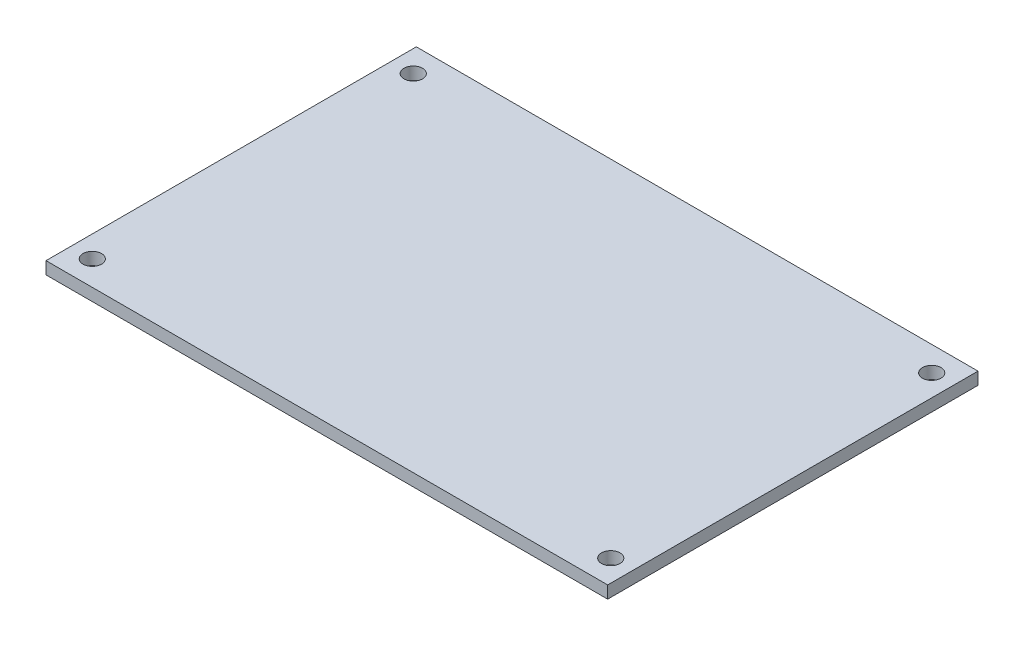
ISO-10303-21;
HEADER;
FILE_DESCRIPTION(('STEP AP214'),'2;1');
FILE_NAME('part.step','',(''),(''),'','','');
FILE_SCHEMA(('AUTOMOTIVE_DESIGN { 1 0 10303 214 1 1 1 1 }'));
ENDSEC;
DATA;
#1=APPLICATION_CONTEXT('core data for automotive mechanical design processes');
#2=APPLICATION_PROTOCOL_DEFINITION('international standard','automotive_design',2000,#1);
#3=PRODUCT_CONTEXT('',#1,'mechanical');
#4=PRODUCT('Part','Part','',(#3));
#5=PRODUCT_RELATED_PRODUCT_CATEGORY('part','',(#4));
#6=PRODUCT_DEFINITION_FORMATION('','',#4);
#7=PRODUCT_DEFINITION_CONTEXT('part definition',#1,'design');
#8=PRODUCT_DEFINITION('design','',#6,#7);
#9=PRODUCT_DEFINITION_SHAPE('','',#8);
#10=(LENGTH_UNIT() NAMED_UNIT(*) SI_UNIT(.MILLI.,.METRE.));
#11=(NAMED_UNIT(*) PLANE_ANGLE_UNIT() SI_UNIT($,.RADIAN.));
#12=(NAMED_UNIT(*) SI_UNIT($,.STERADIAN.) SOLID_ANGLE_UNIT());
#13=UNCERTAINTY_MEASURE_WITH_UNIT(LENGTH_MEASURE(1.E-05),#10,'distance_accuracy_value','');
#14=(GEOMETRIC_REPRESENTATION_CONTEXT(3) GLOBAL_UNCERTAINTY_ASSIGNED_CONTEXT((#13)) GLOBAL_UNIT_ASSIGNED_CONTEXT((#10,
#11,#12)) REPRESENTATION_CONTEXT('',''));
#15=CARTESIAN_POINT('',(0.,0.,0.));
#16=DIRECTION('',(0.,0.,1.));
#17=DIRECTION('',(1.,0.,0.));
#18=AXIS2_PLACEMENT_3D('',#15,#16,#17);
#19=CARTESIAN_POINT('',(45.5,2.,-30.));
#20=DIRECTION('',(-1.,0.,0.));
#21=DIRECTION('',(0.,0.,1.));
#22=AXIS2_PLACEMENT_3D('',#19,#20,#21);
#23=PLANE('',#22);
#24=DIRECTION('',(0.,0.,-1.));
#25=VECTOR('',#24,1.);
#26=CARTESIAN_POINT('',(45.5,0.,-30.));
#27=LINE('',#26,#25);
#28=CARTESIAN_POINT('',(45.5,0.,30.));
#29=VERTEX_POINT('',#28);
#30=CARTESIAN_POINT('',(45.5,0.,-30.));
#31=VERTEX_POINT('',#30);
#32=EDGE_CURVE('E97',#29,#31,#27,.T.);
#33=ORIENTED_EDGE('',*,*,#32,.T.);
#34=DIRECTION('',(0.,-1.,0.));
#35=VECTOR('',#34,1.);
#36=CARTESIAN_POINT('',(45.5,2.,-30.));
#37=LINE('',#36,#35);
#38=CARTESIAN_POINT('',(45.5,2.,-30.));
#39=VERTEX_POINT('',#38);
#40=EDGE_CURVE('E11',#39,#31,#37,.T.);
#41=ORIENTED_EDGE('',*,*,#40,.F.);
#42=DIRECTION('',(0.,0.,-1.));
#43=VECTOR('',#42,1.);
#44=CARTESIAN_POINT('',(45.5,2.,-30.));
#45=LINE('',#44,#43);
#46=CARTESIAN_POINT('',(45.5,2.,30.));
#47=VERTEX_POINT('',#46);
#48=EDGE_CURVE('E85',#47,#39,#45,.T.);
#49=ORIENTED_EDGE('',*,*,#48,.F.);
#50=DIRECTION('',(0.,-1.,0.));
#51=VECTOR('',#50,1.);
#52=CARTESIAN_POINT('',(45.5,2.,30.));
#53=LINE('',#52,#51);
#54=EDGE_CURVE('E93',#47,#29,#53,.T.);
#55=ORIENTED_EDGE('',*,*,#54,.T.);
#56=EDGE_LOOP('',(#33,#41,#49,#55));
#57=FACE_BOUND('',#56,.T.);
#58=ADVANCED_FACE('F34',(#57),#23,.F.);
#59=CARTESIAN_POINT('',(-45.5,2.,-30.));
#60=DIRECTION('',(0.,0.,1.));
#61=DIRECTION('',(1.,0.,0.));
#62=AXIS2_PLACEMENT_3D('',#59,#60,#61);
#63=PLANE('',#62);
#64=DIRECTION('',(-1.,0.,0.));
#65=VECTOR('',#64,1.);
#66=CARTESIAN_POINT('',(-45.5,0.,-30.));
#67=LINE('',#66,#65);
#68=CARTESIAN_POINT('',(-45.5,0.,-30.));
#69=VERTEX_POINT('',#68);
#70=EDGE_CURVE('E89',#31,#69,#67,.T.);
#71=ORIENTED_EDGE('',*,*,#70,.T.);
#72=DIRECTION('',(0.,-1.,0.));
#73=VECTOR('',#72,1.);
#74=CARTESIAN_POINT('',(-45.5,2.,-30.));
#75=LINE('',#74,#73);
#76=CARTESIAN_POINT('',(-45.5,2.,-30.));
#77=VERTEX_POINT('',#76);
#78=EDGE_CURVE('E42',#77,#69,#75,.T.);
#79=ORIENTED_EDGE('',*,*,#78,.F.);
#80=DIRECTION('',(-1.,0.,0.));
#81=VECTOR('',#80,1.);
#82=CARTESIAN_POINT('',(-45.5,2.,-30.));
#83=LINE('',#82,#81);
#84=EDGE_CURVE('E80',#39,#77,#83,.T.);
#85=ORIENTED_EDGE('',*,*,#84,.F.);
#86=ORIENTED_EDGE('',*,*,#40,.T.);
#87=EDGE_LOOP('',(#71,#79,#85,#86));
#88=FACE_BOUND('',#87,.T.);
#89=ADVANCED_FACE('F88',(#88),#63,.F.);
#90=CARTESIAN_POINT('',(-45.5,2.,-30.));
#91=DIRECTION('',(1.,0.,0.));
#92=DIRECTION('',(0.,0.,-1.));
#93=AXIS2_PLACEMENT_3D('',#90,#91,#92);
#94=PLANE('',#93);
#95=DIRECTION('',(0.,0.,1.));
#96=VECTOR('',#95,1.);
#97=CARTESIAN_POINT('',(-45.5,0.,-30.));
#98=LINE('',#97,#96);
#99=CARTESIAN_POINT('',(-45.5,0.,30.));
#100=VERTEX_POINT('',#99);
#101=EDGE_CURVE('E67',#69,#100,#98,.T.);
#102=ORIENTED_EDGE('',*,*,#101,.T.);
#103=DIRECTION('',(0.,-1.,0.));
#104=VECTOR('',#103,1.);
#105=CARTESIAN_POINT('',(-45.5,2.,30.));
#106=LINE('',#105,#104);
#107=CARTESIAN_POINT('',(-45.5,2.,30.));
#108=VERTEX_POINT('',#107);
#109=EDGE_CURVE('E90',#108,#100,#106,.T.);
#110=ORIENTED_EDGE('',*,*,#109,.F.);
#111=DIRECTION('',(0.,0.,1.));
#112=VECTOR('',#111,1.);
#113=CARTESIAN_POINT('',(-45.5,2.,-30.));
#114=LINE('',#113,#112);
#115=EDGE_CURVE('E83',#77,#108,#114,.T.);
#116=ORIENTED_EDGE('',*,*,#115,.F.);
#117=ORIENTED_EDGE('',*,*,#78,.T.);
#118=EDGE_LOOP('',(#102,#110,#116,#117));
#119=FACE_BOUND('',#118,.T.);
#120=ADVANCED_FACE('F91',(#119),#94,.F.);
#121=CARTESIAN_POINT('',(-45.5,2.,30.));
#122=DIRECTION('',(0.,0.,-1.));
#123=DIRECTION('',(-1.,0.,0.));
#124=AXIS2_PLACEMENT_3D('',#121,#122,#123);
#125=PLANE('',#124);
#126=DIRECTION('',(1.,0.,0.));
#127=VECTOR('',#126,1.);
#128=CARTESIAN_POINT('',(-45.5,0.,30.));
#129=LINE('',#128,#127);
#130=EDGE_CURVE('E73',#100,#29,#129,.T.);
#131=ORIENTED_EDGE('',*,*,#130,.T.);
#132=ORIENTED_EDGE('',*,*,#54,.F.);
#133=DIRECTION('',(1.,0.,0.));
#134=VECTOR('',#133,1.);
#135=CARTESIAN_POINT('',(-45.5,2.,30.));
#136=LINE('',#135,#134);
#137=EDGE_CURVE('E50',#108,#47,#136,.T.);
#138=ORIENTED_EDGE('',*,*,#137,.F.);
#139=ORIENTED_EDGE('',*,*,#109,.T.);
#140=EDGE_LOOP('',(#131,#132,#138,#139));
#141=FACE_BOUND('',#140,.T.);
#142=ADVANCED_FACE('F105',(#141),#125,.F.);
#143=CARTESIAN_POINT('',(0.,2.,0.));
#144=DIRECTION('',(0.,1.,0.));
#145=DIRECTION('',(0.,0.,1.));
#146=AXIS2_PLACEMENT_3D('',#143,#144,#145);
#147=PLANE('',#146);
#148=CARTESIAN_POINT('',(42.,2.,-26.));
#149=DIRECTION('',(0.,1.,0.));
#150=DIRECTION('',(0.,0.,-1.));
#151=AXIS2_PLACEMENT_3D('',#148,#149,#150);
#152=CIRCLE('',#151,1.5);
#153=CARTESIAN_POINT('',(42.,2.,-27.5));
#154=VERTEX_POINT('',#153);
#155=EDGE_CURVE('E124',#154,#154,#152,.T.);
#156=ORIENTED_EDGE('',*,*,#155,.F.);
#157=EDGE_LOOP('',(#156));
#158=FACE_BOUND('',#157,.T.);
#159=CARTESIAN_POINT('',(-42.,2.,26.));
#160=DIRECTION('',(0.,1.,0.));
#161=DIRECTION('',(0.,0.,-1.));
#162=AXIS2_PLACEMENT_3D('',#159,#160,#161);
#163=CIRCLE('',#162,1.5);
#164=CARTESIAN_POINT('',(-42.,2.,24.5));
#165=VERTEX_POINT('',#164);
#166=EDGE_CURVE('E117',#165,#165,#163,.T.);
#167=ORIENTED_EDGE('',*,*,#166,.F.);
#168=EDGE_LOOP('',(#167));
#169=FACE_BOUND('',#168,.T.);
#170=CARTESIAN_POINT('',(42.,2.,26.));
#171=DIRECTION('',(0.,1.,0.));
#172=DIRECTION('',(0.,0.,1.));
#173=AXIS2_PLACEMENT_3D('',#170,#171,#172);
#174=CIRCLE('',#173,1.5);
#175=CARTESIAN_POINT('',(42.,2.,27.5));
#176=VERTEX_POINT('',#175);
#177=EDGE_CURVE('E129',#176,#176,#174,.T.);
#178=ORIENTED_EDGE('',*,*,#177,.F.);
#179=EDGE_LOOP('',(#178));
#180=FACE_BOUND('',#179,.T.);
#181=CARTESIAN_POINT('',(-42.,2.,-26.));
#182=DIRECTION('',(0.,1.,0.));
#183=DIRECTION('',(0.,0.,1.));
#184=AXIS2_PLACEMENT_3D('',#181,#182,#183);
#185=CIRCLE('',#184,1.5);
#186=CARTESIAN_POINT('',(-42.,2.,-24.5));
#187=VERTEX_POINT('',#186);
#188=EDGE_CURVE('E111',#187,#187,#185,.T.);
#189=ORIENTED_EDGE('',*,*,#188,.F.);
#190=EDGE_LOOP('',(#189));
#191=FACE_BOUND('',#190,.T.);
#192=ORIENTED_EDGE('',*,*,#48,.T.);
#193=ORIENTED_EDGE('',*,*,#84,.T.);
#194=ORIENTED_EDGE('',*,*,#115,.T.);
#195=ORIENTED_EDGE('',*,*,#137,.T.);
#196=EDGE_LOOP('',(#192,#193,#194,#195));
#197=FACE_BOUND('',#196,.T.);
#198=ADVANCED_FACE('F81',(#158,#169,#180,#191,#197),#147,.T.);
#199=CARTESIAN_POINT('',(0.,0.,0.));
#200=DIRECTION('',(0.,1.,0.));
#201=DIRECTION('',(0.,0.,1.));
#202=AXIS2_PLACEMENT_3D('',#199,#200,#201);
#203=PLANE('',#202);
#204=CARTESIAN_POINT('',(42.,0.,-26.));
#205=DIRECTION('',(0.,1.,0.));
#206=DIRECTION('',(0.,0.,-1.));
#207=AXIS2_PLACEMENT_3D('',#204,#205,#206);
#208=CIRCLE('',#207,1.5);
#209=CARTESIAN_POINT('',(42.,0.,-27.5));
#210=VERTEX_POINT('',#209);
#211=EDGE_CURVE('E114',#210,#210,#208,.T.);
#212=ORIENTED_EDGE('',*,*,#211,.T.);
#213=EDGE_LOOP('',(#212));
#214=FACE_BOUND('',#213,.T.);
#215=CARTESIAN_POINT('',(-42.,0.,26.));
#216=DIRECTION('',(0.,1.,0.));
#217=DIRECTION('',(0.,0.,-1.));
#218=AXIS2_PLACEMENT_3D('',#215,#216,#217);
#219=CIRCLE('',#218,1.5);
#220=CARTESIAN_POINT('',(-42.,0.,24.5));
#221=VERTEX_POINT('',#220);
#222=EDGE_CURVE('E120',#221,#221,#219,.T.);
#223=ORIENTED_EDGE('',*,*,#222,.T.);
#224=EDGE_LOOP('',(#223));
#225=FACE_BOUND('',#224,.T.);
#226=CARTESIAN_POINT('',(42.,0.,26.));
#227=DIRECTION('',(0.,1.,0.));
#228=DIRECTION('',(0.,0.,1.));
#229=AXIS2_PLACEMENT_3D('',#226,#227,#228);
#230=CIRCLE('',#229,1.5);
#231=CARTESIAN_POINT('',(42.,0.,27.5));
#232=VERTEX_POINT('',#231);
#233=EDGE_CURVE('E121',#232,#232,#230,.T.);
#234=ORIENTED_EDGE('',*,*,#233,.T.);
#235=EDGE_LOOP('',(#234));
#236=FACE_BOUND('',#235,.T.);
#237=CARTESIAN_POINT('',(-42.,0.,-26.));
#238=DIRECTION('',(0.,1.,0.));
#239=DIRECTION('',(0.,0.,1.));
#240=AXIS2_PLACEMENT_3D('',#237,#238,#239);
#241=CIRCLE('',#240,1.5);
#242=CARTESIAN_POINT('',(-42.,0.,-24.5));
#243=VERTEX_POINT('',#242);
#244=EDGE_CURVE('E100',#243,#243,#241,.T.);
#245=ORIENTED_EDGE('',*,*,#244,.T.);
#246=EDGE_LOOP('',(#245));
#247=FACE_BOUND('',#246,.T.);
#248=ORIENTED_EDGE('',*,*,#32,.F.);
#249=ORIENTED_EDGE('',*,*,#130,.F.);
#250=ORIENTED_EDGE('',*,*,#101,.F.);
#251=ORIENTED_EDGE('',*,*,#70,.F.);
#252=EDGE_LOOP('',(#248,#249,#250,#251));
#253=FACE_BOUND('',#252,.T.);
#254=ADVANCED_FACE('F108',(#214,#225,#236,#247,#253),#203,.F.);
#255=CARTESIAN_POINT('',(-42.,0.,-26.));
#256=DIRECTION('',(0.,1.,0.));
#257=DIRECTION('',(0.,0.,1.));
#258=AXIS2_PLACEMENT_3D('',#255,#256,#257);
#259=CYLINDRICAL_SURFACE('',#258,1.5);
#260=ORIENTED_EDGE('',*,*,#244,.F.);
#261=EDGE_LOOP('',(#260));
#262=FACE_BOUND('',#261,.T.);
#263=ORIENTED_EDGE('',*,*,#188,.T.);
#264=EDGE_LOOP('',(#263));
#265=FACE_BOUND('',#264,.T.);
#266=ADVANCED_FACE('F141',(#262,#265),#259,.F.);
#267=CARTESIAN_POINT('',(42.,0.,26.));
#268=DIRECTION('',(0.,1.,0.));
#269=DIRECTION('',(0.,0.,1.));
#270=AXIS2_PLACEMENT_3D('',#267,#268,#269);
#271=CYLINDRICAL_SURFACE('',#270,1.5);
#272=ORIENTED_EDGE('',*,*,#233,.F.);
#273=EDGE_LOOP('',(#272));
#274=FACE_BOUND('',#273,.T.);
#275=ORIENTED_EDGE('',*,*,#177,.T.);
#276=EDGE_LOOP('',(#275));
#277=FACE_BOUND('',#276,.T.);
#278=ADVANCED_FACE('F137',(#274,#277),#271,.F.);
#279=CARTESIAN_POINT('',(-42.,0.,26.));
#280=DIRECTION('',(0.,1.,0.));
#281=DIRECTION('',(0.,0.,1.));
#282=AXIS2_PLACEMENT_3D('',#279,#280,#281);
#283=CYLINDRICAL_SURFACE('',#282,1.5);
#284=ORIENTED_EDGE('',*,*,#222,.F.);
#285=EDGE_LOOP('',(#284));
#286=FACE_BOUND('',#285,.T.);
#287=ORIENTED_EDGE('',*,*,#166,.T.);
#288=EDGE_LOOP('',(#287));
#289=FACE_BOUND('',#288,.T.);
#290=ADVANCED_FACE('F140',(#286,#289),#283,.F.);
#291=CARTESIAN_POINT('',(42.,0.,-26.));
#292=DIRECTION('',(0.,1.,0.));
#293=DIRECTION('',(0.,0.,1.));
#294=AXIS2_PLACEMENT_3D('',#291,#292,#293);
#295=CYLINDRICAL_SURFACE('',#294,1.5);
#296=ORIENTED_EDGE('',*,*,#211,.F.);
#297=EDGE_LOOP('',(#296));
#298=FACE_BOUND('',#297,.T.);
#299=ORIENTED_EDGE('',*,*,#155,.T.);
#300=EDGE_LOOP('',(#299));
#301=FACE_BOUND('',#300,.T.);
#302=ADVANCED_FACE('F202',(#298,#301),#295,.F.);
#303=CLOSED_SHELL('',(#58,#89,#120,#142,#198,#254,#266,#278,#290,#302));
#304=MANIFOLD_SOLID_BREP('B2',#303);
#305=ADVANCED_BREP_SHAPE_REPRESENTATION('',(#18,#304),#14);
#306=SHAPE_DEFINITION_REPRESENTATION(#9,#305);
ENDSEC;
END-ISO-10303-21;
